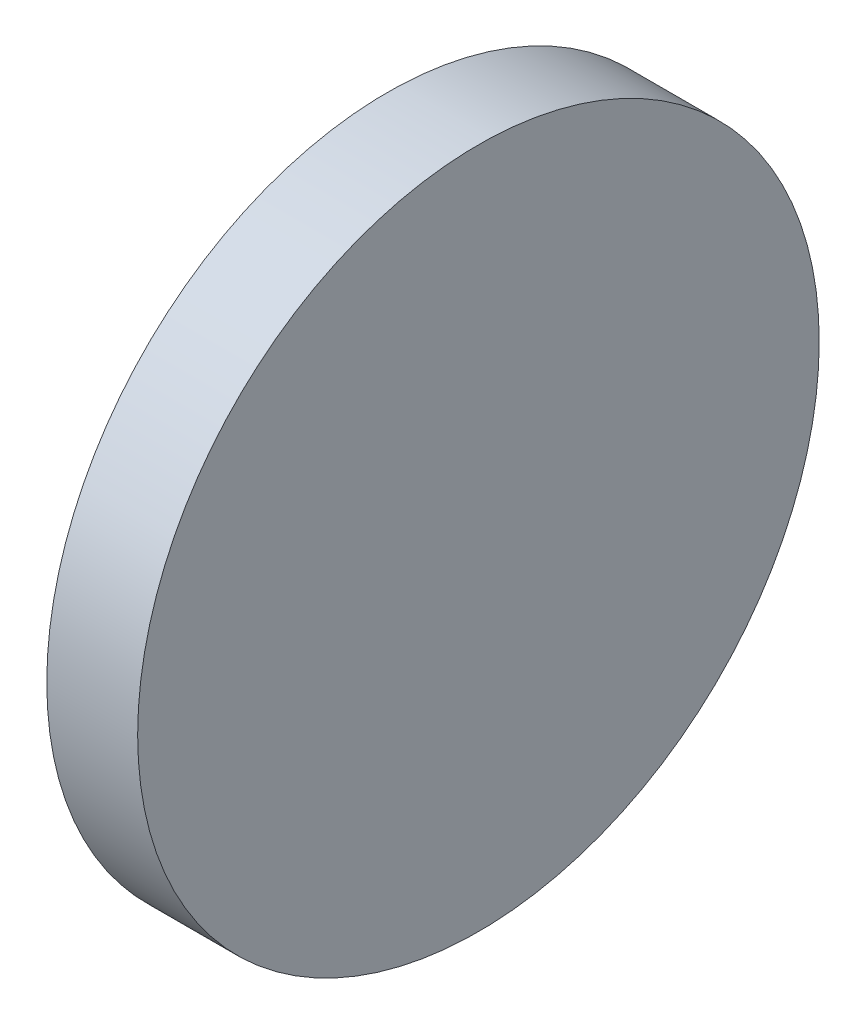
ISO-10303-21;
HEADER;
FILE_DESCRIPTION(('STEP AP214'),'2;1');
FILE_NAME('part.step','',(''),(''),'','','');
FILE_SCHEMA(('AUTOMOTIVE_DESIGN { 1 0 10303 214 1 1 1 1 }'));
ENDSEC;
DATA;
#1=APPLICATION_CONTEXT('core data for automotive mechanical design processes');
#2=APPLICATION_PROTOCOL_DEFINITION('international standard','automotive_design',2000,#1);
#3=PRODUCT_CONTEXT('',#1,'mechanical');
#4=PRODUCT('Part','Part','',(#3));
#5=PRODUCT_RELATED_PRODUCT_CATEGORY('part','',(#4));
#6=PRODUCT_DEFINITION_FORMATION('','',#4);
#7=PRODUCT_DEFINITION_CONTEXT('part definition',#1,'design');
#8=PRODUCT_DEFINITION('design','',#6,#7);
#9=PRODUCT_DEFINITION_SHAPE('','',#8);
#10=(LENGTH_UNIT() NAMED_UNIT(*) SI_UNIT(.MILLI.,.METRE.));
#11=(NAMED_UNIT(*) PLANE_ANGLE_UNIT() SI_UNIT($,.RADIAN.));
#12=(NAMED_UNIT(*) SI_UNIT($,.STERADIAN.) SOLID_ANGLE_UNIT());
#13=UNCERTAINTY_MEASURE_WITH_UNIT(LENGTH_MEASURE(1.E-05),#10,'distance_accuracy_value','');
#14=(GEOMETRIC_REPRESENTATION_CONTEXT(3) GLOBAL_UNCERTAINTY_ASSIGNED_CONTEXT((#13)) GLOBAL_UNIT_ASSIGNED_CONTEXT((#10,
#11,#12)) REPRESENTATION_CONTEXT('',''));
#15=CARTESIAN_POINT('',(0.,0.,0.));
#16=DIRECTION('',(0.,0.,1.));
#17=DIRECTION('',(1.,0.,0.));
#18=AXIS2_PLACEMENT_3D('',#15,#16,#17);
#19=CARTESIAN_POINT('',(130.063998529894,38.6465896745077,0.));
#20=DIRECTION('',(1.,0.,0.));
#21=DIRECTION('',(0.,0.,-1.));
#22=AXIS2_PLACEMENT_3D('',#19,#20,#21);
#23=PLANE('',#22);
#24=CARTESIAN_POINT('',(130.063998529894,38.6465896745077,0.));
#25=DIRECTION('',(-1.,0.,0.));
#26=DIRECTION('',(0.,0.,1.));
#27=AXIS2_PLACEMENT_3D('',#24,#25,#26);
#28=CIRCLE('',#27,7.5);
#29=CARTESIAN_POINT('',(130.063998529894,38.6465896745077,7.5));
#30=VERTEX_POINT('',#29);
#31=EDGE_CURVE('E10',#30,#30,#28,.T.);
#32=ORIENTED_EDGE('',*,*,#31,.T.);
#33=EDGE_LOOP('',(#32));
#34=FACE_BOUND('',#33,.T.);
#35=ADVANCED_FACE('F35',(#34),#23,.F.);
#36=CARTESIAN_POINT('',(127.000400996308,38.6465896745077,0.));
#37=DIRECTION('',(-1.,0.,0.));
#38=DIRECTION('',(0.,0.,1.));
#39=AXIS2_PLACEMENT_3D('',#36,#37,#38);
#40=CYLINDRICAL_SURFACE('',#39,7.5);
#41=ORIENTED_EDGE('',*,*,#31,.F.);
#42=EDGE_LOOP('',(#41));
#43=FACE_BOUND('',#42,.T.);
#44=CARTESIAN_POINT('',(132.063998529894,38.6465896745077,0.));
#45=DIRECTION('',(-1.,0.,0.));
#46=DIRECTION('',(0.,0.,1.));
#47=AXIS2_PLACEMENT_3D('',#44,#45,#46);
#48=CIRCLE('',#47,7.5);
#49=CARTESIAN_POINT('',(132.063998529894,38.6465896745077,7.5));
#50=VERTEX_POINT('',#49);
#51=EDGE_CURVE('E41',#50,#50,#48,.T.);
#52=ORIENTED_EDGE('',*,*,#51,.T.);
#53=EDGE_LOOP('',(#52));
#54=FACE_BOUND('',#53,.T.);
#55=ADVANCED_FACE('F47',(#43,#54),#40,.T.);
#56=CARTESIAN_POINT('',(132.063998529894,46.1465896745077,0.));
#57=DIRECTION('',(-1.,0.,0.));
#58=DIRECTION('',(0.,0.,1.));
#59=AXIS2_PLACEMENT_3D('',#56,#57,#58);
#60=PLANE('',#59);
#61=ORIENTED_EDGE('',*,*,#51,.F.);
#62=EDGE_LOOP('',(#61));
#63=FACE_BOUND('',#62,.T.);
#64=ADVANCED_FACE('F49',(#63),#60,.F.);
#65=CLOSED_SHELL('',(#35,#55,#64));
#66=MANIFOLD_SOLID_BREP('B2',#65);
#67=ADVANCED_BREP_SHAPE_REPRESENTATION('',(#18,#66),#14);
#68=SHAPE_DEFINITION_REPRESENTATION(#9,#67);
ENDSEC;
END-ISO-10303-21;
